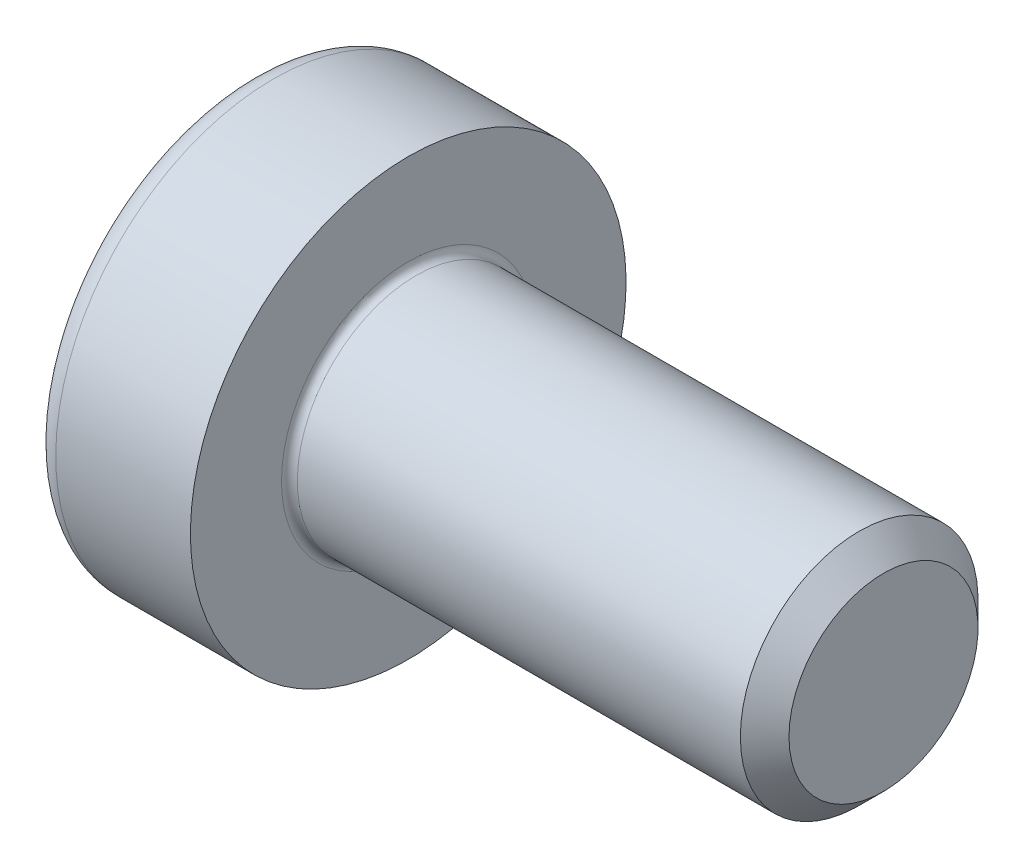
ISO-10303-21;
HEADER;
FILE_DESCRIPTION(('STEP AP214'),'2;1');
FILE_NAME('part.step','',(''),(''),'','','');
FILE_SCHEMA(('AUTOMOTIVE_DESIGN { 1 0 10303 214 1 1 1 1 }'));
ENDSEC;
DATA;
#1=APPLICATION_CONTEXT('core data for automotive mechanical design processes');
#2=APPLICATION_PROTOCOL_DEFINITION('international standard','automotive_design',2000,#1);
#3=PRODUCT_CONTEXT('',#1,'mechanical');
#4=PRODUCT('Part','Part','',(#3));
#5=PRODUCT_RELATED_PRODUCT_CATEGORY('part','',(#4));
#6=PRODUCT_DEFINITION_FORMATION('','',#4);
#7=PRODUCT_DEFINITION_CONTEXT('part definition',#1,'design');
#8=PRODUCT_DEFINITION('design','',#6,#7);
#9=PRODUCT_DEFINITION_SHAPE('','',#8);
#10=(LENGTH_UNIT() NAMED_UNIT(*) SI_UNIT(.MILLI.,.METRE.));
#11=(NAMED_UNIT(*) PLANE_ANGLE_UNIT() SI_UNIT($,.RADIAN.));
#12=(NAMED_UNIT(*) SI_UNIT($,.STERADIAN.) SOLID_ANGLE_UNIT());
#13=UNCERTAINTY_MEASURE_WITH_UNIT(LENGTH_MEASURE(1.E-05),#10,'distance_accuracy_value','');
#14=(GEOMETRIC_REPRESENTATION_CONTEXT(3) GLOBAL_UNCERTAINTY_ASSIGNED_CONTEXT((#13)) GLOBAL_UNIT_ASSIGNED_CONTEXT((#10,
#11,#12)) REPRESENTATION_CONTEXT('',''));
#15=CARTESIAN_POINT('',(0.,0.,0.));
#16=DIRECTION('',(0.,0.,1.));
#17=DIRECTION('',(1.,0.,0.));
#18=AXIS2_PLACEMENT_3D('',#15,#16,#17);
#19=CARTESIAN_POINT('',(-0.504000000034921,0.,0.));
#20=DIRECTION('',(-1.,0.,0.));
#21=DIRECTION('',(0.,0.,1.));
#22=AXIS2_PLACEMENT_3D('',#19,#20,#21);
#23=CONICAL_SURFACE('',#22,1.16162874161319,1.04719755104339);
#24=CARTESIAN_POINT('',(0.166666666871151,0.,0.));
#25=VERTEX_POINT('',#24);
#26=VERTEX_LOOP('',#25);
#27=FACE_BOUND('',#26,.T.);
#28=CARTESIAN_POINT('',(-0.500000000033452,1.00000000000617,-0.577350269186062));
#29=CARTESIAN_POINT('',(-0.48534777259097,0.956056056223177,-0.602721316958429));
#30=CARTESIAN_POINT('',(-0.472022338572395,0.911732788942336,-0.628311367254386));
#31=CARTESIAN_POINT('',(-0.448763193713064,0.822318826655777,-0.679934542449842));
#32=CARTESIAN_POINT('',(-0.438837710177994,0.777226543454147,-0.705968584294678));
#33=CARTESIAN_POINT('',(-0.423387979476166,0.687600783112728,-0.757714041154121));
#34=CARTESIAN_POINT('',(-0.417760893799616,0.643081092182043,-0.783417496697191));
#35=CARTESIAN_POINT('',(-0.411044584064503,0.553832339755308,-0.834945287935605));
#36=CARTESIAN_POINT('',(-0.409949796986451,0.509103602431622,-0.860769436469947));
#37=CARTESIAN_POINT('',(-0.412233145078711,0.42553275512848,-0.909019087656821));
#38=CARTESIAN_POINT('',(-0.415050642610843,0.386678104662532,-0.931451830562605));
#39=CARTESIAN_POINT('',(-0.423978650365497,0.309221929104465,-0.976171174371454));
#40=CARTESIAN_POINT('',(-0.430092207393062,0.270620671712616,-0.998457620717696));
#41=CARTESIAN_POINT('',(-0.445374916683399,0.193004929128127,-1.0432690905922));
#42=CARTESIAN_POINT('',(-0.454608821126639,0.154000262299649,-1.06578844548528));
#43=CARTESIAN_POINT('',(-0.47556588044426,0.0765725149914007,-1.11049137623644));
#44=CARTESIAN_POINT('',(-0.487284114404528,0.0381484433378786,-1.13267552434896));
#45=CARTESIAN_POINT('',(-0.500000000032462,-3.20480926115147E-12,-1.1547005383811));
#46=B_SPLINE_CURVE_WITH_KNOTS('',3,(#28,#29,#30,#31,#32,#33,#34,#35,#36,#37,#38,#39,#40,#41,#42,
#43,#44,#45),.UNSPECIFIED.,.F.,.F.,(4,2,2,2,2,2,2,2,4),(0.,0.158508005788236,0.317396908533536,
0.472353803103511,0.627120444482842,0.761853891346267,0.896712096924011,1.03456081126957,
1.17213898678093),.UNSPECIFIED.);
#47=CARTESIAN_POINT('',(-0.500000000032412,1.00000000000309,-0.57735026918781));
#48=VERTEX_POINT('',#47);
#49=CARTESIAN_POINT('',(-0.500000000038849,1.92846324897649E-12,-1.15470053838732));
#50=VERTEX_POINT('',#49);
#51=EDGE_CURVE('E59',#48,#50,#46,.T.);
#52=ORIENTED_EDGE('',*,*,#51,.T.);
#53=CARTESIAN_POINT('',(-0.500000000032678,3.85638068721359E-12,-1.15470053838148));
#54=CARTESIAN_POINT('',(-0.48534777259026,-0.0439439437791009,-1.12932949060913));
#55=CARTESIAN_POINT('',(-0.472022338571752,-0.0882672110599031,-1.1037394403132));
#56=CARTESIAN_POINT('',(-0.448763193712561,-0.177681173346381,-1.05211626511779));
#57=CARTESIAN_POINT('',(-0.438837710177563,-0.222773456547968,-1.02608222327298));
#58=CARTESIAN_POINT('',(-0.423387979475878,-0.312399216889303,-0.974336766413583));
#59=CARTESIAN_POINT('',(-0.4177608937994,-0.356918907819946,-0.948633310870537));
#60=CARTESIAN_POINT('',(-0.411044584064424,-0.446167660246591,-0.897105519632175));
#61=CARTESIAN_POINT('',(-0.409949796986439,-0.490896397570231,-0.871281371097859));
#62=CARTESIAN_POINT('',(-0.412233145078808,-0.574467244873148,-0.823031719911115));
#63=CARTESIAN_POINT('',(-0.415050642610973,-0.61332189533892,-0.800598977005432));
#64=CARTESIAN_POINT('',(-0.423978650365659,-0.690778070896636,-0.755879633196786));
#65=CARTESIAN_POINT('',(-0.430092207393223,-0.729379328288309,-0.733593186850646));
#66=CARTESIAN_POINT('',(-0.445374916683529,-0.806995070872441,-0.688781716976345));
#67=CARTESIAN_POINT('',(-0.454608821126738,-0.845999737700737,-0.666262362083376));
#68=CARTESIAN_POINT('',(-0.475565880444271,-0.923427485008628,-0.621559431332419));
#69=CARTESIAN_POINT('',(-0.487284114404484,-0.961851556661974,-0.599375283219998));
#70=CARTESIAN_POINT('',(-0.500000000032354,-1.00000000000288,-0.577350269187958));
#71=B_SPLINE_CURVE_WITH_KNOTS('',3,(#53,#54,#55,#56,#57,#58,#59,#60,#61,#62,#63,#64,#65,#66,#67,
#68,#69,#70),.UNSPECIFIED.,.F.,.F.,(4,2,2,2,2,2,2,2,4),(0.,0.158508005788055,0.317396908533169,
0.472353803102975,0.627120444482141,0.761853891344966,0.896712096922107,1.03456081126703,
1.17213898677776),.UNSPECIFIED.);
#72=CARTESIAN_POINT('',(-0.500000000031874,-1.00000000000144,-0.577350269188791));
#73=VERTEX_POINT('',#72);
#74=EDGE_CURVE('E229',#50,#73,#71,.T.);
#75=ORIENTED_EDGE('',*,*,#74,.T.);
#76=CARTESIAN_POINT('',(-0.500000000032095,-1.,-0.577350269192055));
#77=CARTESIAN_POINT('',(-0.485347772589724,-1.,-0.526608173647401));
#78=CARTESIAN_POINT('',(-0.472022338571267,-1.,-0.475428073055565));
#79=CARTESIAN_POINT('',(-0.448763193712182,-1.,-0.372181722664818));
#80=CARTESIAN_POINT('',(-0.438837710177239,-1.,-0.320113638975233));
#81=CARTESIAN_POINT('',(-0.423387979475662,-1.,-0.216622725256518));
#82=CARTESIAN_POINT('',(-0.417760893799238,-1.,-0.165215814170463));
#83=CARTESIAN_POINT('',(-0.411044584064366,-1.,-0.0621602316938158));
#84=CARTESIAN_POINT('',(-0.409949796986431,-1.,-0.0105119346252258));
#85=CARTESIAN_POINT('',(-0.412233145078883,-1.,0.085987367748016));
#86=CARTESIAN_POINT('',(-0.415050642611066,-1.,0.130852853559175));
#87=CARTESIAN_POINT('',(-0.423978650365759,-1.,0.220291541176056));
#88=CARTESIAN_POINT('',(-0.43009220739331,-1.,0.264864433868131));
#89=CARTESIAN_POINT('',(-0.445374916683561,-1.,0.354487373616317));
#90=CARTESIAN_POINT('',(-0.454608821126726,-1.,0.399526083402043));
#91=CARTESIAN_POINT('',(-0.47556588044415,-1.,0.488931944903541));
#92=CARTESIAN_POINT('',(-0.487284114404298,-1.,0.533300241128179));
#93=CARTESIAN_POINT('',(-0.500000000032095,-1.,0.577350269192057));
#94=B_SPLINE_CURVE_WITH_KNOTS('',3,(#76,#77,#78,#79,#80,#81,#82,#83,#84,#85,#86,#87,#88,#89,#90,
#91,#92,#93),.UNSPECIFIED.,.F.,.F.,(4,2,2,2,2,2,2,2,4),(0.,0.158508005787918,0.317396908532891,
0.472353803102571,0.627120444481611,0.761853891343826,0.896712096920353,1.03456081126463,
1.17213898677472),.UNSPECIFIED.);
#95=CARTESIAN_POINT('',(-0.500000000032225,-1.00000000000144,0.577350269190009));
#96=VERTEX_POINT('',#95);
#97=EDGE_CURVE('E123',#73,#96,#94,.T.);
#98=ORIENTED_EDGE('',*,*,#97,.T.);
#99=CARTESIAN_POINT('',(-0.500000000032355,-1.00000000000288,0.577350269187961));
#100=CARTESIAN_POINT('',(-0.485347772589963,-0.956056056219943,0.602721316960296));
#101=CARTESIAN_POINT('',(-0.472022338571483,-0.911732788939157,0.628311367256221));
#102=CARTESIAN_POINT('',(-0.448763193712351,-0.822318826652713,0.679934542451611));
#103=CARTESIAN_POINT('',(-0.438837710177383,-0.777226543451143,0.705968584296412));
#104=CARTESIAN_POINT('',(-0.423387979475759,-0.687600783109844,0.757714041155786));
#105=CARTESIAN_POINT('',(-0.41776089379931,-0.643081092179219,0.783417496698821));
#106=CARTESIAN_POINT('',(-0.411044584064392,-0.55383233975261,0.834945287937162));
#107=CARTESIAN_POINT('',(-0.409949796986435,-0.509103602428991,0.860769436471466));
#108=CARTESIAN_POINT('',(-0.412233145078852,-0.425532755126129,0.909019087658178));
#109=CARTESIAN_POINT('',(-0.415050642611034,-0.386678104660392,0.93145183056384));
#110=CARTESIAN_POINT('',(-0.423978650365749,-0.309221929102748,0.976171174372445));
#111=CARTESIAN_POINT('',(-0.430092207393324,-0.270620671711111,0.998457620718564));
#112=CARTESIAN_POINT('',(-0.445374916683644,-0.193004929127053,1.04326909059282));
#113=CARTESIAN_POINT('',(-0.454608821126855,-0.154000262298795,1.06578844548577));
#114=CARTESIAN_POINT('',(-0.475565880444388,-0.0765725149909784,1.11049137623668));
#115=CARTESIAN_POINT('',(-0.487284114404598,-0.038148443337669,1.13267552434908));
#116=CARTESIAN_POINT('',(-0.500000000032462,3.20514497659552E-12,1.1547005383811));
#117=B_SPLINE_CURVE_WITH_KNOTS('',3,(#99,#100,#101,#102,#103,#104,#105,#106,#107,#108,#109,#110,
#111,#112,#113,#114,#115,#116),.UNSPECIFIED.,.F.,.F.,(4,2,2,2,2,2,2,2,4),(0.,0.15850800578798,
0.317396908533017,0.472353803102752,0.627120444481848,0.761853891344554,0.896712096921576,
1.03456081126637,1.17213898677698),.UNSPECIFIED.);
#118=CARTESIAN_POINT('',(-0.500000000101863,-7.03780799049508E-13,1.1547005384035));
#119=VERTEX_POINT('',#118);
#120=EDGE_CURVE('E129',#96,#119,#117,.T.);
#121=ORIENTED_EDGE('',*,*,#120,.T.);
#122=CARTESIAN_POINT('',(-0.500000000032678,-3.8561698710761E-12,1.15470053838148));
#123=CARTESIAN_POINT('',(-0.48534777259026,0.0439439437791009,1.12932949060913));
#124=CARTESIAN_POINT('',(-0.472022338571752,0.0882672110599027,1.1037394403132));
#125=CARTESIAN_POINT('',(-0.448763193712561,0.17768117334638,1.05211626511779));
#126=CARTESIAN_POINT('',(-0.438837710177563,0.222773456547967,1.02608222327298));
#127=CARTESIAN_POINT('',(-0.423387979475878,0.312399216889302,0.974336766413583));
#128=CARTESIAN_POINT('',(-0.417760893799399,0.356918907819945,0.948633310870537));
#129=CARTESIAN_POINT('',(-0.411044584064424,0.446167660246591,0.897105519632174));
#130=CARTESIAN_POINT('',(-0.409949796986438,0.490896397570231,0.871281371097859));
#131=CARTESIAN_POINT('',(-0.412233145078806,0.574467244873083,0.823031719911152));
#132=CARTESIAN_POINT('',(-0.415050642610963,0.613321895338789,0.800598977005508));
#133=CARTESIAN_POINT('',(-0.423978650365623,0.690778070896375,0.755879633196936));
#134=CARTESIAN_POINT('',(-0.430092207393169,0.729379328287983,0.733593186850833));
#135=CARTESIAN_POINT('',(-0.445374916683429,0.806995070871984,0.688781716976608));
#136=CARTESIAN_POINT('',(-0.454608821126609,0.845999737700214,0.666262362083677));
#137=CARTESIAN_POINT('',(-0.475565880444081,0.923427485007975,0.621559431332795));
#138=CARTESIAN_POINT('',(-0.48728411440426,0.961851556661258,0.599375283220411));
#139=CARTESIAN_POINT('',(-0.500000000032094,1.00000000000211,0.577350269188407));
#140=B_SPLINE_CURVE_WITH_KNOTS('',3,(#122,#123,#124,#125,#126,#127,#128,#129,#130,#131,#132,
#133,#134,#135,#136,#137,#138,#139),.UNSPECIFIED.,.F.,.F.,(4,2,2,2,2,2,2,2,4),(0.,
0.158508005788054,0.317396908533167,0.472353803102974,0.627120444482141,0.761853891344738,
0.89671209692165,1.03456081126633,1.17213898677683),.UNSPECIFIED.);
#141=CARTESIAN_POINT('',(-0.500000000032224,1.00000000000105,0.577350269190681));
#142=VERTEX_POINT('',#141);
#143=EDGE_CURVE('E135',#119,#142,#140,.T.);
#144=ORIENTED_EDGE('',*,*,#143,.T.);
#145=CARTESIAN_POINT('',(-0.500000000032354,1.,0.577350269192954));
#146=CARTESIAN_POINT('',(-0.485347772589963,1.,0.526608173648285));
#147=CARTESIAN_POINT('',(-0.472022338571483,1.,0.475428073056435));
#148=CARTESIAN_POINT('',(-0.448763193712352,1.,0.372181722665658));
#149=CARTESIAN_POINT('',(-0.438837710177384,1.,0.320113638976058));
#150=CARTESIAN_POINT('',(-0.423387979475759,1.,0.21662272525731));
#151=CARTESIAN_POINT('',(-0.41776089379931,0.999999999999999,0.165215814171238));
#152=CARTESIAN_POINT('',(-0.411044584064392,0.999999999999999,0.0621602316945545));
#153=CARTESIAN_POINT('',(-0.409949796986434,0.999999999999999,0.0105119346259454));
#154=CARTESIAN_POINT('',(-0.412233145078844,0.999999999999999,-0.0859873677471626));
#155=CARTESIAN_POINT('',(-0.415050642610994,0.999999999999999,-0.130852853558168));
#156=CARTESIAN_POINT('',(-0.423978650365599,0.999999999999999,-0.220291541174748));
#157=CARTESIAN_POINT('',(-0.430092207393097,0.999999999999999,-0.264864433866674));
#158=CARTESIAN_POINT('',(-0.445374916683223,0.999999999999999,-0.354487373614558));
#159=CARTESIAN_POINT('',(-0.454608821126318,0.999999999999999,-0.399526083400132));
#160=CARTESIAN_POINT('',(-0.475565880443592,0.999999999999999,-0.488931944901333));
#161=CARTESIAN_POINT('',(-0.487284114403659,0.999999999999998,-0.533300241125824));
#162=CARTESIAN_POINT('',(-0.500000000031373,0.999999999999998,-0.577350269189559));
#163=B_SPLINE_CURVE_WITH_KNOTS('',3,(#145,#146,#147,#148,#149,#150,#151,#152,#153,#154,#155,
#156,#157,#158,#159,#160,#161,#162),.UNSPECIFIED.,.F.,.F.,(4,2,2,2,2,2,2,2,4),(0.,
0.158508005787976,0.317396908533009,0.472353803102748,0.627120444481847,0.761853891343598,
0.896712096919662,1.03456081126345,1.17213898677306),.UNSPECIFIED.);
#164=EDGE_CURVE('E141',#142,#48,#163,.T.);
#165=ORIENTED_EDGE('',*,*,#164,.T.);
#166=EDGE_LOOP('',(#52,#75,#98,#121,#144,#165));
#167=FACE_BOUND('',#166,.T.);
#168=ADVANCED_FACE('F17',(#27,#167),#23,.F.);
#169=CARTESIAN_POINT('',(-2.,0.,-1.15470053837925));
#170=DIRECTION('',(0.,-0.5,-0.866025403784438));
#171=DIRECTION('',(0.,0.866025403784438,-0.5));
#172=AXIS2_PLACEMENT_3D('',#169,#170,#171);
#173=PLANE('',#172);
#174=DIRECTION('',(0.,0.866025403784438,-0.5));
#175=VECTOR('',#174,1.);
#176=CARTESIAN_POINT('',(-2.,-1.,-0.577350269189624));
#177=LINE('',#176,#175);
#178=CARTESIAN_POINT('',(-2.,-1.,-0.577350269189624));
#179=VERTEX_POINT('',#178);
#180=CARTESIAN_POINT('',(-2.,1.2903504083668E-12,-1.15470053837864));
#181=VERTEX_POINT('',#180);
#182=EDGE_CURVE('E117',#179,#181,#177,.T.);
#183=ORIENTED_EDGE('',*,*,#182,.F.);
#184=DIRECTION('',(1.,0.,0.));
#185=VECTOR('',#184,1.);
#186=CARTESIAN_POINT('',(-2.,-1.,-0.577350269189624));
#187=LINE('',#186,#185);
#188=EDGE_CURVE('E114',#179,#73,#187,.T.);
#189=ORIENTED_EDGE('',*,*,#188,.T.);
#190=ORIENTED_EDGE('',*,*,#74,.F.);
#191=DIRECTION('',(1.,0.,0.));
#192=VECTOR('',#191,1.);
#193=CARTESIAN_POINT('',(-2.,2.81480568020687E-12,-1.15470053837763));
#194=LINE('',#193,#192);
#195=EDGE_CURVE('E144',#50,#181,#194,.F.);
#196=ORIENTED_EDGE('',*,*,#195,.T.);
#197=EDGE_LOOP('',(#183,#189,#190,#196));
#198=FACE_BOUND('',#197,.T.);
#199=ADVANCED_FACE('F64',(#198),#173,.F.);
#200=CARTESIAN_POINT('',(-2.,0.999999999999999,-0.577350269189627));
#201=DIRECTION('',(0.,0.5,-0.866025403784439));
#202=DIRECTION('',(0.,0.866025403784439,0.5));
#203=AXIS2_PLACEMENT_3D('',#200,#201,#202);
#204=PLANE('',#203);
#205=DIRECTION('',(0.,0.866025403784439,0.499999999999999));
#206=VECTOR('',#205,1.);
#207=CARTESIAN_POINT('',(-2.,0.,-1.15470053837925));
#208=LINE('',#207,#206);
#209=CARTESIAN_POINT('',(-2.,0.999999999999999,-0.577350269185565));
#210=VERTEX_POINT('',#209);
#211=EDGE_CURVE('E151',#181,#210,#208,.T.);
#212=ORIENTED_EDGE('',*,*,#211,.F.);
#213=ORIENTED_EDGE('',*,*,#195,.F.);
#214=ORIENTED_EDGE('',*,*,#51,.F.);
#215=DIRECTION('',(1.,0.,0.));
#216=VECTOR('',#215,1.);
#217=CARTESIAN_POINT('',(-2.,0.999999999999998,-0.577350269183128));
#218=LINE('',#217,#216);
#219=EDGE_CURVE('E138',#48,#210,#218,.F.);
#220=ORIENTED_EDGE('',*,*,#219,.T.);
#221=EDGE_LOOP('',(#212,#213,#214,#220));
#222=FACE_BOUND('',#221,.T.);
#223=ADVANCED_FACE('F70',(#222),#204,.F.);
#224=CARTESIAN_POINT('',(-2.,1.,0.577350269189624));
#225=DIRECTION('',(0.,1.,0.));
#226=DIRECTION('',(0.,0.,1.));
#227=AXIS2_PLACEMENT_3D('',#224,#225,#226);
#228=PLANE('',#227);
#229=DIRECTION('',(0.,0.,1.));
#230=VECTOR('',#229,1.);
#231=CARTESIAN_POINT('',(-2.,0.999999999999999,0.));
#232=LINE('',#231,#230);
#233=CARTESIAN_POINT('',(-2.,0.999999999998241,0.577350269190638));
#234=VERTEX_POINT('',#233);
#235=EDGE_CURVE('E167',#210,#234,#232,.T.);
#236=ORIENTED_EDGE('',*,*,#235,.F.);
#237=ORIENTED_EDGE('',*,*,#219,.F.);
#238=ORIENTED_EDGE('',*,*,#164,.F.);
#239=DIRECTION('',(1.,0.,0.));
#240=VECTOR('',#239,1.);
#241=CARTESIAN_POINT('',(-2.,0.999999999997186,0.577350269191247));
#242=LINE('',#241,#240);
#243=EDGE_CURVE('E132',#142,#234,#242,.F.);
#244=ORIENTED_EDGE('',*,*,#243,.T.);
#245=EDGE_LOOP('',(#236,#237,#238,#244));
#246=FACE_BOUND('',#245,.T.);
#247=ADVANCED_FACE('F211',(#246),#228,.F.);
#248=CARTESIAN_POINT('',(-2.,0.,1.15470053837925));
#249=DIRECTION('',(0.,0.500000000000001,0.866025403784438));
#250=DIRECTION('',(0.,-0.866025403784438,0.500000000000001));
#251=AXIS2_PLACEMENT_3D('',#248,#249,#250);
#252=PLANE('',#251);
#253=DIRECTION('',(0.,-0.866025403784438,0.500000000000001));
#254=VECTOR('',#253,1.);
#255=CARTESIAN_POINT('',(-2.,0.999999999999999,0.577350269189624));
#256=LINE('',#255,#254);
#257=CARTESIAN_POINT('',(-2.,-1.7592890468572E-12,1.15470053837824));
#258=VERTEX_POINT('',#257);
#259=EDGE_CURVE('E162',#234,#258,#256,.T.);
#260=ORIENTED_EDGE('',*,*,#259,.F.);
#261=ORIENTED_EDGE('',*,*,#243,.F.);
#262=ORIENTED_EDGE('',*,*,#143,.F.);
#263=DIRECTION('',(1.,0.,0.));
#264=VECTOR('',#263,1.);
#265=CARTESIAN_POINT('',(-2.,-2.81480568020687E-12,1.15470053837763));
#266=LINE('',#265,#264);
#267=EDGE_CURVE('E126',#119,#258,#266,.F.);
#268=ORIENTED_EDGE('',*,*,#267,.T.);
#269=EDGE_LOOP('',(#260,#261,#262,#268));
#270=FACE_BOUND('',#269,.T.);
#271=ADVANCED_FACE('F206',(#270),#252,.F.);
#272=CARTESIAN_POINT('',(-2.,-1.,0.577350269189626));
#273=DIRECTION('',(0.,-0.5,0.866025403784439));
#274=DIRECTION('',(0.,-0.866025403784439,-0.5));
#275=AXIS2_PLACEMENT_3D('',#272,#273,#274);
#276=PLANE('',#275);
#277=DIRECTION('',(0.,-0.866025403784439,-0.499999999999999));
#278=VECTOR('',#277,1.);
#279=CARTESIAN_POINT('',(-2.,0.,1.15470053837925));
#280=LINE('',#279,#278);
#281=CARTESIAN_POINT('',(-2.,-1.,0.577350269187595));
#282=VERTEX_POINT('',#281);
#283=EDGE_CURVE('E157',#258,#282,#280,.T.);
#284=ORIENTED_EDGE('',*,*,#283,.F.);
#285=ORIENTED_EDGE('',*,*,#267,.F.);
#286=ORIENTED_EDGE('',*,*,#120,.F.);
#287=DIRECTION('',(1.,0.,0.));
#288=VECTOR('',#287,1.);
#289=CARTESIAN_POINT('',(-2.,-1.,0.577350269186377));
#290=LINE('',#289,#288);
#291=EDGE_CURVE('E118',#96,#282,#290,.F.);
#292=ORIENTED_EDGE('',*,*,#291,.T.);
#293=EDGE_LOOP('',(#284,#285,#286,#292));
#294=FACE_BOUND('',#293,.T.);
#295=ADVANCED_FACE('F201',(#294),#276,.F.);
#296=CARTESIAN_POINT('',(-2.,-1.,-0.577350269189625));
#297=DIRECTION('',(0.,-1.,0.));
#298=DIRECTION('',(1.,0.,0.));
#299=AXIS2_PLACEMENT_3D('',#296,#297,#298);
#300=PLANE('',#299);
#301=DIRECTION('',(0.,0.,1.));
#302=VECTOR('',#301,1.);
#303=CARTESIAN_POINT('',(-2.,-1.,0.));
#304=LINE('',#303,#302);
#305=EDGE_CURVE('E154',#282,#179,#304,.F.);
#306=ORIENTED_EDGE('',*,*,#305,.F.);
#307=ORIENTED_EDGE('',*,*,#291,.F.);
#308=ORIENTED_EDGE('',*,*,#97,.F.);
#309=ORIENTED_EDGE('',*,*,#188,.F.);
#310=EDGE_LOOP('',(#306,#307,#308,#309));
#311=FACE_BOUND('',#310,.T.);
#312=ADVANCED_FACE('F197',(#311),#300,.F.);
#313=CARTESIAN_POINT('',(-2.,1.95235026918963,0.));
#314=DIRECTION('',(-1.,0.,0.));
#315=DIRECTION('',(0.,-1.,0.));
#316=AXIS2_PLACEMENT_3D('',#313,#314,#315);
#317=PLANE('',#316);
#318=CARTESIAN_POINT('',(-2.,0.,0.));
#319=DIRECTION('',(1.,0.,0.));
#320=DIRECTION('',(0.,1.,0.));
#321=AXIS2_PLACEMENT_3D('',#318,#319,#320);
#322=CIRCLE('',#321,2.45);
#323=CARTESIAN_POINT('',(-2.,2.45,0.));
#324=VERTEX_POINT('',#323);
#325=EDGE_CURVE('E113',#324,#324,#322,.T.);
#326=ORIENTED_EDGE('',*,*,#325,.F.);
#327=EDGE_LOOP('',(#326));
#328=FACE_BOUND('',#327,.T.);
#329=ORIENTED_EDGE('',*,*,#283,.T.);
#330=ORIENTED_EDGE('',*,*,#305,.T.);
#331=ORIENTED_EDGE('',*,*,#182,.T.);
#332=ORIENTED_EDGE('',*,*,#211,.T.);
#333=ORIENTED_EDGE('',*,*,#235,.T.);
#334=ORIENTED_EDGE('',*,*,#259,.T.);
#335=EDGE_LOOP('',(#329,#330,#331,#332,#333,#334));
#336=FACE_BOUND('',#335,.T.);
#337=ADVANCED_FACE('F200',(#328,#336),#317,.T.);
#338=CARTESIAN_POINT('',(-1.7,0.,0.));
#339=DIRECTION('',(1.,0.,0.));
#340=DIRECTION('',(0.,1.,0.));
#341=AXIS2_PLACEMENT_3D('',#338,#339,#340);
#342=TOROIDAL_SURFACE('',#341,2.45,0.300000000000001);
#343=CARTESIAN_POINT('',(-1.7,0.,0.));
#344=DIRECTION('',(1.,0.,0.));
#345=DIRECTION('',(0.,1.,0.));
#346=AXIS2_PLACEMENT_3D('',#343,#344,#345);
#347=CIRCLE('',#346,2.75);
#348=CARTESIAN_POINT('',(-1.7,2.75,0.));
#349=VERTEX_POINT('',#348);
#350=EDGE_CURVE('E105',#349,#349,#347,.T.);
#351=ORIENTED_EDGE('',*,*,#350,.F.);
#352=EDGE_LOOP('',(#351));
#353=FACE_BOUND('',#352,.T.);
#354=ORIENTED_EDGE('',*,*,#325,.T.);
#355=EDGE_LOOP('',(#354));
#356=FACE_BOUND('',#355,.T.);
#357=ADVANCED_FACE('F269',(#353,#356),#342,.T.);
#358=CARTESIAN_POINT('',(-0.999999999999996,0.,0.));
#359=DIRECTION('',(1.,0.,0.));
#360=DIRECTION('',(0.,1.,0.));
#361=AXIS2_PLACEMENT_3D('',#358,#359,#360);
#362=CYLINDRICAL_SURFACE('',#361,2.75);
#363=ORIENTED_EDGE('',*,*,#350,.T.);
#364=EDGE_LOOP('',(#363));
#365=FACE_BOUND('',#364,.T.);
#366=CARTESIAN_POINT('',(0.,0.,0.));
#367=DIRECTION('',(1.,0.,0.));
#368=DIRECTION('',(0.,1.,0.));
#369=AXIS2_PLACEMENT_3D('',#366,#367,#368);
#370=CIRCLE('',#369,2.75);
#371=CARTESIAN_POINT('',(0.,2.75,0.));
#372=VERTEX_POINT('',#371);
#373=EDGE_CURVE('E104',#372,#372,#370,.T.);
#374=ORIENTED_EDGE('',*,*,#373,.F.);
#375=EDGE_LOOP('',(#374));
#376=FACE_BOUND('',#375,.T.);
#377=ADVANCED_FACE('F94',(#365,#376),#362,.T.);
#378=CARTESIAN_POINT('',(0.,2.125,0.));
#379=DIRECTION('',(1.,0.,0.));
#380=DIRECTION('',(0.,1.,0.));
#381=AXIS2_PLACEMENT_3D('',#378,#379,#380);
#382=PLANE('',#381);
#383=ORIENTED_EDGE('',*,*,#373,.T.);
#384=EDGE_LOOP('',(#383));
#385=FACE_BOUND('',#384,.T.);
#386=CARTESIAN_POINT('',(0.,0.,-1.6));
#387=CARTESIAN_POINT('',(0.,-0.304449951016725,-1.6001009257119));
#388=CARTESIAN_POINT('',(0.,-0.588951535298995,-1.48766128169989));
#389=CARTESIAN_POINT('',(0.,-0.896214094659146,-1.36622613089104));
#390=CARTESIAN_POINT('',(0.,-1.13137084989847,-1.13137084989848));
#391=CARTESIAN_POINT('',(0.,-1.36508531011187,-0.897956014889474));
#392=CARTESIAN_POINT('',(0.,-1.48766128169989,-0.588951535299007));
#393=CARTESIAN_POINT('',(0.,-1.59980408211201,-0.306248267829627));
#394=CARTESIAN_POINT('',(0.,-1.6,0.));
#395=CARTESIAN_POINT('',(0.,-1.60019461578501,0.304212890729989));
#396=CARTESIAN_POINT('',(0.,-1.48766128169989,0.588951535298987));
#397=CARTESIAN_POINT('',(0.,-1.36622613089144,0.89621409465832));
#398=CARTESIAN_POINT('',(0.,-1.13137084989848,1.13137084989847));
#399=CARTESIAN_POINT('',(0.,-0.897956014890013,1.36508531011175));
#400=CARTESIAN_POINT('',(0.,-0.588951535299002,1.48766128169989));
#401=CARTESIAN_POINT('',(0.,-0.306010103754814,1.59989855709463));
#402=CARTESIAN_POINT('',(0.,0.,1.6));
#403=B_SPLINE_CURVE_WITH_KNOTS('',2,(#386,#387,#388,#389,#390,#391,#392,#393,#394,#395,#396,
#397,#398,#399,#400,#401,#402),.UNSPECIFIED.,.F.,.F.,(3,2,2,2,2,2,2,2,3),(0.,0.125,0.25,0.375,
0.5,0.625,0.75,0.875,1.),.UNSPECIFIED.);
#404=CARTESIAN_POINT('',(0.,0.,-1.6));
#405=VERTEX_POINT('',#404);
#406=CARTESIAN_POINT('',(0.,0.,1.6));
#407=VERTEX_POINT('',#406);
#408=EDGE_CURVE('E34',#405,#407,#403,.T.);
#409=ORIENTED_EDGE('',*,*,#408,.T.);
#410=CARTESIAN_POINT('',(0.,0.,1.6));
#411=CARTESIAN_POINT('',(0.,0.304449951016785,1.6001009257119));
#412=CARTESIAN_POINT('',(0.,0.588951535299,1.48766128169989));
#413=CARTESIAN_POINT('',(0.,0.89621409465884,1.36622613089113));
#414=CARTESIAN_POINT('',(0.,1.13137084989848,1.13137084989847));
#415=CARTESIAN_POINT('',(0.,1.36508499852708,0.897956326075019));
#416=CARTESIAN_POINT('',(0.,1.48766128169989,0.588951535298992));
#417=CARTESIAN_POINT('',(0.,1.59990576220706,0.305992374545344));
#418=CARTESIAN_POINT('',(0.,1.6,0.));
#419=CARTESIAN_POINT('',(0.,1.60009376834225,-0.30446805689882));
#420=CARTESIAN_POINT('',(0.,1.48766128169989,-0.588951535299003));
#421=CARTESIAN_POINT('',(0.,1.36622613380686,-0.896214091739088));
#422=CARTESIAN_POINT('',(0.,1.13137084989847,-1.13137084989848));
#423=CARTESIAN_POINT('',(0.,0.897956014889921,-1.36508531011191));
#424=CARTESIAN_POINT('',(0.,0.588951535298992,-1.48766128169989));
#425=CARTESIAN_POINT('',(0.,0.306010103754522,-1.59989855709463));
#426=CARTESIAN_POINT('',(0.,0.,-1.6));
#427=B_SPLINE_CURVE_WITH_KNOTS('',2,(#410,#411,#412,#413,#414,#415,#416,#417,#418,#419,#420,
#421,#422,#423,#424,#425,#426),.UNSPECIFIED.,.F.,.F.,(3,2,2,2,2,2,2,2,3),(0.,0.125,0.25,0.375,
0.5,0.625,0.75,0.875,1.),.UNSPECIFIED.);
#428=EDGE_CURVE('E101',#407,#405,#427,.T.);
#429=ORIENTED_EDGE('',*,*,#428,.T.);
#430=EDGE_LOOP('',(#409,#429));
#431=FACE_BOUND('',#430,.T.);
#432=ADVANCED_FACE('F89',(#385,#431),#382,.T.);
#433=CARTESIAN_POINT('',(6.00000000000001,0.749999999999999,0.));
#434=DIRECTION('',(1.,0.,0.));
#435=DIRECTION('',(0.,1.,0.));
#436=AXIS2_PLACEMENT_3D('',#433,#434,#435);
#437=PLANE('',#436);
#438=CARTESIAN_POINT('',(5.99999999997181,0.,0.));
#439=DIRECTION('',(-1.,0.,0.));
#440=DIRECTION('',(0.,0.,1.));
#441=AXIS2_PLACEMENT_3D('',#438,#439,#440);
#442=CIRCLE('',#441,1.19327500004829);
#443=CARTESIAN_POINT('',(5.99999999997181,0.,1.19327500004829));
#444=VERTEX_POINT('',#443);
#445=EDGE_CURVE('E180',#444,#444,#442,.T.);
#446=ORIENTED_EDGE('',*,*,#445,.F.);
#447=EDGE_LOOP('',(#446));
#448=FACE_BOUND('',#447,.T.);
#449=ADVANCED_FACE('F86',(#448),#437,.T.);
#450=CARTESIAN_POINT('',(0.100000000000002,0.,0.));
#451=DIRECTION('',(1.,0.,0.));
#452=DIRECTION('',(0.,1.,0.));
#453=AXIS2_PLACEMENT_3D('',#450,#451,#452);
#454=TOROIDAL_SURFACE('',#453,1.6,0.1);
#455=ORIENTED_EDGE('',*,*,#408,.F.);
#456=ORIENTED_EDGE('',*,*,#428,.F.);
#457=EDGE_LOOP('',(#455,#456));
#458=FACE_BOUND('',#457,.T.);
#459=CARTESIAN_POINT('',(0.100000000000002,0.,0.));
#460=DIRECTION('',(1.,0.,0.));
#461=DIRECTION('',(0.,1.,0.));
#462=AXIS2_PLACEMENT_3D('',#459,#460,#461);
#463=CIRCLE('',#462,1.5);
#464=CARTESIAN_POINT('',(0.100000000000002,1.5,0.));
#465=VERTEX_POINT('',#464);
#466=EDGE_CURVE('E21',#465,#465,#463,.T.);
#467=ORIENTED_EDGE('',*,*,#466,.F.);
#468=EDGE_LOOP('',(#467));
#469=FACE_BOUND('',#468,.T.);
#470=ADVANCED_FACE('F19',(#458,#469),#454,.F.);
#471=CARTESIAN_POINT('',(5.69327500005556,0.,0.));
#472=DIRECTION('',(-1.,0.,0.));
#473=DIRECTION('',(0.,0.,1.));
#474=AXIS2_PLACEMENT_3D('',#471,#472,#473);
#475=CONICAL_SURFACE('',#474,1.49999999996453,0.785398163397448);
#476=CARTESIAN_POINT('',(5.69327500000001,0.,0.));
#477=DIRECTION('',(1.,0.,0.));
#478=DIRECTION('',(0.,1.,0.));
#479=AXIS2_PLACEMENT_3D('',#476,#477,#478);
#480=CIRCLE('',#479,1.5);
#481=CARTESIAN_POINT('',(5.69327500000001,1.5,0.));
#482=VERTEX_POINT('',#481);
#483=EDGE_CURVE('E11',#482,#482,#480,.F.);
#484=ORIENTED_EDGE('',*,*,#483,.F.);
#485=EDGE_LOOP('',(#484));
#486=FACE_BOUND('',#485,.T.);
#487=ORIENTED_EDGE('',*,*,#445,.T.);
#488=EDGE_LOOP('',(#487));
#489=FACE_BOUND('',#488,.T.);
#490=ADVANCED_FACE('F76',(#486,#489),#475,.T.);
#491=CARTESIAN_POINT('',(3.75,0.,0.));
#492=DIRECTION('',(1.,0.,0.));
#493=DIRECTION('',(0.,1.,0.));
#494=AXIS2_PLACEMENT_3D('',#491,#492,#493);
#495=CYLINDRICAL_SURFACE('',#494,1.5);
#496=ORIENTED_EDGE('',*,*,#483,.T.);
#497=EDGE_LOOP('',(#496));
#498=FACE_BOUND('',#497,.T.);
#499=ORIENTED_EDGE('',*,*,#466,.T.);
#500=EDGE_LOOP('',(#499));
#501=FACE_BOUND('',#500,.T.);
#502=ADVANCED_FACE('F74',(#498,#501),#495,.T.);
#503=CLOSED_SHELL('',(#168,#199,#223,#247,#271,#295,#312,#337,#357,#377,#432,#449,#470,#490,#502));
#504=MANIFOLD_SOLID_BREP('B1',#503);
#505=ADVANCED_BREP_SHAPE_REPRESENTATION('',(#18,#504),#14);
#506=SHAPE_DEFINITION_REPRESENTATION(#9,#505);
ENDSEC;
END-ISO-10303-21;
